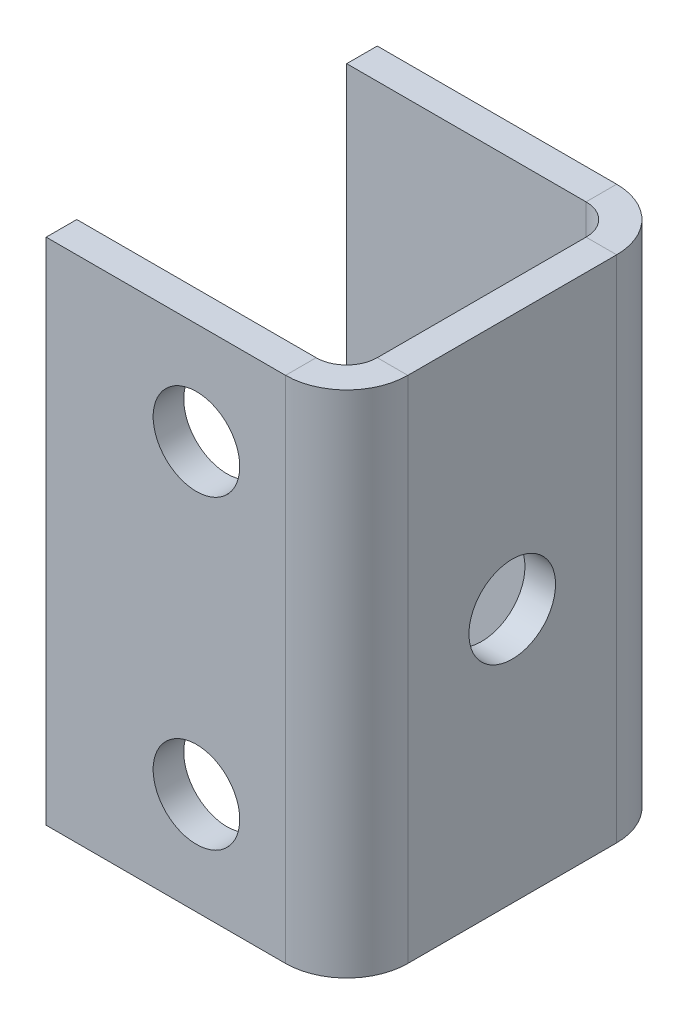
ISO-10303-21;
HEADER;
FILE_DESCRIPTION(('STEP AP214'),'2;1');
FILE_NAME('part.step','',(''),(''),'','','');
FILE_SCHEMA(('AUTOMOTIVE_DESIGN { 1 0 10303 214 1 1 1 1 }'));
ENDSEC;
DATA;
#1=APPLICATION_CONTEXT('core data for automotive mechanical design processes');
#2=APPLICATION_PROTOCOL_DEFINITION('international standard','automotive_design',2000,#1);
#3=PRODUCT_CONTEXT('',#1,'mechanical');
#4=PRODUCT('Part','Part','',(#3));
#5=PRODUCT_RELATED_PRODUCT_CATEGORY('part','',(#4));
#6=PRODUCT_DEFINITION_FORMATION('','',#4);
#7=PRODUCT_DEFINITION_CONTEXT('part definition',#1,'design');
#8=PRODUCT_DEFINITION('design','',#6,#7);
#9=PRODUCT_DEFINITION_SHAPE('','',#8);
#10=(LENGTH_UNIT() NAMED_UNIT(*) SI_UNIT(.MILLI.,.METRE.));
#11=(NAMED_UNIT(*) PLANE_ANGLE_UNIT() SI_UNIT($,.RADIAN.));
#12=(NAMED_UNIT(*) SI_UNIT($,.STERADIAN.) SOLID_ANGLE_UNIT());
#13=UNCERTAINTY_MEASURE_WITH_UNIT(LENGTH_MEASURE(1.E-05),#10,'distance_accuracy_value','');
#14=(GEOMETRIC_REPRESENTATION_CONTEXT(3) GLOBAL_UNCERTAINTY_ASSIGNED_CONTEXT((#13)) GLOBAL_UNIT_ASSIGNED_CONTEXT((#10,
#11,#12)) REPRESENTATION_CONTEXT('',''));
#15=CARTESIAN_POINT('',(0.,0.,0.));
#16=DIRECTION('',(0.,0.,1.));
#17=DIRECTION('',(1.,0.,0.));
#18=AXIS2_PLACEMENT_3D('',#15,#16,#17);
#19=CARTESIAN_POINT('',(574.5,60.,503.5));
#20=DIRECTION('',(0.,-1.,0.));
#21=DIRECTION('',(0.,0.,-1.));
#22=AXIS2_PLACEMENT_3D('',#19,#20,#21);
#23=PLANE('',#22);
#24=DIRECTION('',(1.,0.,0.));
#25=VECTOR('',#24,1.);
#26=CARTESIAN_POINT('',(586.5,60.,503.5));
#27=LINE('',#26,#25);
#28=CARTESIAN_POINT('',(580.5,60.,503.5));
#29=VERTEX_POINT('',#28);
#30=CARTESIAN_POINT('',(586.5,60.,503.5));
#31=VERTEX_POINT('',#30);
#32=EDGE_CURVE('E11',#29,#31,#27,.T.);
#33=ORIENTED_EDGE('',*,*,#32,.F.);
#34=CARTESIAN_POINT('',(574.5,60.,503.5));
#35=DIRECTION('',(0.,1.,0.));
#36=DIRECTION('',(0.,0.,1.));
#37=AXIS2_PLACEMENT_3D('',#34,#35,#36);
#38=CIRCLE('',#37,6.);
#39=CARTESIAN_POINT('',(574.5,60.,509.5));
#40=VERTEX_POINT('',#39);
#41=EDGE_CURVE('E103',#40,#29,#38,.T.);
#42=ORIENTED_EDGE('',*,*,#41,.F.);
#43=DIRECTION('',(0.,0.,1.));
#44=VECTOR('',#43,1.);
#45=CARTESIAN_POINT('',(574.5,60.,515.5));
#46=LINE('',#45,#44);
#47=CARTESIAN_POINT('',(574.5,60.,515.5));
#48=VERTEX_POINT('',#47);
#49=EDGE_CURVE('E51',#40,#48,#46,.T.);
#50=ORIENTED_EDGE('',*,*,#49,.T.);
#51=CARTESIAN_POINT('',(574.5,60.,503.5));
#52=DIRECTION('',(0.,1.,0.));
#53=DIRECTION('',(1.,0.,0.));
#54=AXIS2_PLACEMENT_3D('',#51,#52,#53);
#55=CIRCLE('',#54,12.);
#56=EDGE_CURVE('E106',#48,#31,#55,.T.);
#57=ORIENTED_EDGE('',*,*,#56,.T.);
#58=EDGE_LOOP('',(#33,#42,#50,#57));
#59=FACE_BOUND('',#58,.T.);
#60=ADVANCED_FACE('F40',(#59),#23,.F.);
#61=CARTESIAN_POINT('',(527.5,60.,515.5));
#62=DIRECTION('',(0.,-1.,0.));
#63=DIRECTION('',(1.,0.,0.));
#64=AXIS2_PLACEMENT_3D('',#61,#62,#63);
#65=PLANE('',#64);
#66=ORIENTED_EDGE('',*,*,#49,.F.);
#67=DIRECTION('',(1.,0.,0.));
#68=VECTOR('',#67,1.);
#69=CARTESIAN_POINT('',(527.5,60.,509.5));
#70=LINE('',#69,#68);
#71=CARTESIAN_POINT('',(527.5,60.,509.5));
#72=VERTEX_POINT('',#71);
#73=EDGE_CURVE('E158',#72,#40,#70,.T.);
#74=ORIENTED_EDGE('',*,*,#73,.F.);
#75=DIRECTION('',(0.,0.,1.));
#76=VECTOR('',#75,1.);
#77=CARTESIAN_POINT('',(527.5,60.,515.5));
#78=LINE('',#77,#76);
#79=CARTESIAN_POINT('',(527.5,60.,515.5));
#80=VERTEX_POINT('',#79);
#81=EDGE_CURVE('E188',#72,#80,#78,.T.);
#82=ORIENTED_EDGE('',*,*,#81,.T.);
#83=DIRECTION('',(1.,0.,0.));
#84=VECTOR('',#83,1.);
#85=CARTESIAN_POINT('',(527.5,60.,515.5));
#86=LINE('',#85,#84);
#87=EDGE_CURVE('E213',#80,#48,#86,.T.);
#88=ORIENTED_EDGE('',*,*,#87,.T.);
#89=EDGE_LOOP('',(#66,#74,#82,#88));
#90=FACE_BOUND('',#89,.T.);
#91=ADVANCED_FACE('F214',(#90),#65,.F.);
#92=CARTESIAN_POINT('',(527.5,-40.,515.5));
#93=DIRECTION('',(1.,0.,0.));
#94=DIRECTION('',(0.,1.,0.));
#95=AXIS2_PLACEMENT_3D('',#92,#93,#94);
#96=PLANE('',#95);
#97=ORIENTED_EDGE('',*,*,#81,.F.);
#98=DIRECTION('',(0.,1.,0.));
#99=VECTOR('',#98,1.);
#100=CARTESIAN_POINT('',(527.5,-40.,509.5));
#101=LINE('',#100,#99);
#102=CARTESIAN_POINT('',(527.5,-40.,509.5));
#103=VERTEX_POINT('',#102);
#104=EDGE_CURVE('E311',#103,#72,#101,.T.);
#105=ORIENTED_EDGE('',*,*,#104,.F.);
#106=DIRECTION('',(0.,0.,1.));
#107=VECTOR('',#106,1.);
#108=CARTESIAN_POINT('',(527.5,-40.,515.5));
#109=LINE('',#108,#107);
#110=CARTESIAN_POINT('',(527.5,-40.,515.5));
#111=VERTEX_POINT('',#110);
#112=EDGE_CURVE('E184',#103,#111,#109,.T.);
#113=ORIENTED_EDGE('',*,*,#112,.T.);
#114=DIRECTION('',(0.,1.,0.));
#115=VECTOR('',#114,1.);
#116=CARTESIAN_POINT('',(527.5,-40.,515.5));
#117=LINE('',#116,#115);
#118=EDGE_CURVE('E219',#111,#80,#117,.T.);
#119=ORIENTED_EDGE('',*,*,#118,.T.);
#120=EDGE_LOOP('',(#97,#105,#113,#119));
#121=FACE_BOUND('',#120,.T.);
#122=ADVANCED_FACE('F321',(#121),#96,.F.);
#123=CARTESIAN_POINT('',(527.5,-40.,515.5));
#124=DIRECTION('',(0.,-1.,0.));
#125=DIRECTION('',(1.,0.,0.));
#126=AXIS2_PLACEMENT_3D('',#123,#124,#125);
#127=PLANE('',#126);
#128=ORIENTED_EDGE('',*,*,#112,.F.);
#129=DIRECTION('',(1.,0.,0.));
#130=VECTOR('',#129,1.);
#131=CARTESIAN_POINT('',(527.5,-40.,509.5));
#132=LINE('',#131,#130);
#133=CARTESIAN_POINT('',(574.5,-40.,509.5));
#134=VERTEX_POINT('',#133);
#135=EDGE_CURVE('E285',#103,#134,#132,.T.);
#136=ORIENTED_EDGE('',*,*,#135,.T.);
#137=DIRECTION('',(0.,0.,1.));
#138=VECTOR('',#137,1.);
#139=CARTESIAN_POINT('',(574.5,-40.,515.5));
#140=LINE('',#139,#138);
#141=CARTESIAN_POINT('',(574.5,-40.,515.5));
#142=VERTEX_POINT('',#141);
#143=EDGE_CURVE('E180',#134,#142,#140,.T.);
#144=ORIENTED_EDGE('',*,*,#143,.T.);
#145=DIRECTION('',(1.,0.,0.));
#146=VECTOR('',#145,1.);
#147=CARTESIAN_POINT('',(527.5,-40.,515.5));
#148=LINE('',#147,#146);
#149=EDGE_CURVE('E225',#111,#142,#148,.T.);
#150=ORIENTED_EDGE('',*,*,#149,.F.);
#151=EDGE_LOOP('',(#128,#136,#144,#150));
#152=FACE_BOUND('',#151,.T.);
#153=ADVANCED_FACE('F403',(#152),#127,.T.);
#154=CARTESIAN_POINT('',(574.5,-40.,503.5));
#155=DIRECTION('',(0.,-1.,0.));
#156=DIRECTION('',(0.,0.,-1.));
#157=AXIS2_PLACEMENT_3D('',#154,#155,#156);
#158=PLANE('',#157);
#159=ORIENTED_EDGE('',*,*,#143,.F.);
#160=CARTESIAN_POINT('',(574.5,-40.,503.5));
#161=DIRECTION('',(0.,1.,0.));
#162=DIRECTION('',(0.,0.,1.));
#163=AXIS2_PLACEMENT_3D('',#160,#161,#162);
#164=CIRCLE('',#163,6.);
#165=CARTESIAN_POINT('',(580.5,-40.,503.5));
#166=VERTEX_POINT('',#165);
#167=EDGE_CURVE('E134',#134,#166,#164,.T.);
#168=ORIENTED_EDGE('',*,*,#167,.T.);
#169=DIRECTION('',(1.,0.,0.));
#170=VECTOR('',#169,1.);
#171=CARTESIAN_POINT('',(586.5,-40.,503.5));
#172=LINE('',#171,#170);
#173=CARTESIAN_POINT('',(586.5,-40.,503.5));
#174=VERTEX_POINT('',#173);
#175=EDGE_CURVE('E176',#166,#174,#172,.T.);
#176=ORIENTED_EDGE('',*,*,#175,.T.);
#177=CARTESIAN_POINT('',(574.5,-40.,503.5));
#178=DIRECTION('',(0.,1.,0.));
#179=DIRECTION('',(1.,0.,0.));
#180=AXIS2_PLACEMENT_3D('',#177,#178,#179);
#181=CIRCLE('',#180,12.);
#182=EDGE_CURVE('E209',#142,#174,#181,.T.);
#183=ORIENTED_EDGE('',*,*,#182,.F.);
#184=EDGE_LOOP('',(#159,#168,#176,#183));
#185=FACE_BOUND('',#184,.T.);
#186=ADVANCED_FACE('F399',(#185),#158,.T.);
#187=CARTESIAN_POINT('',(586.5,-40.,509.5));
#188=DIRECTION('',(0.,-1.,0.));
#189=DIRECTION('',(0.,0.,-1.));
#190=AXIS2_PLACEMENT_3D('',#187,#188,#189);
#191=PLANE('',#190);
#192=ORIENTED_EDGE('',*,*,#175,.F.);
#193=DIRECTION('',(0.,0.,-1.));
#194=VECTOR('',#193,1.);
#195=CARTESIAN_POINT('',(580.5,-40.,509.5));
#196=LINE('',#195,#194);
#197=CARTESIAN_POINT('',(580.5,-40.,462.5));
#198=VERTEX_POINT('',#197);
#199=EDGE_CURVE('E122',#166,#198,#196,.T.);
#200=ORIENTED_EDGE('',*,*,#199,.T.);
#201=DIRECTION('',(1.,0.,0.));
#202=VECTOR('',#201,1.);
#203=CARTESIAN_POINT('',(586.5,-40.,462.5));
#204=LINE('',#203,#202);
#205=CARTESIAN_POINT('',(586.5,-40.,462.5));
#206=VERTEX_POINT('',#205);
#207=EDGE_CURVE('E172',#198,#206,#204,.T.);
#208=ORIENTED_EDGE('',*,*,#207,.T.);
#209=DIRECTION('',(0.,0.,-1.));
#210=VECTOR('',#209,1.);
#211=CARTESIAN_POINT('',(586.5,-40.,509.5));
#212=LINE('',#211,#210);
#213=EDGE_CURVE('E243',#174,#206,#212,.T.);
#214=ORIENTED_EDGE('',*,*,#213,.F.);
#215=EDGE_LOOP('',(#192,#200,#208,#214));
#216=FACE_BOUND('',#215,.T.);
#217=ADVANCED_FACE('F395',(#216),#191,.T.);
#218=CARTESIAN_POINT('',(574.5,-40.,462.5));
#219=DIRECTION('',(0.,-1.,0.));
#220=DIRECTION('',(0.,0.,-1.));
#221=AXIS2_PLACEMENT_3D('',#218,#219,#220);
#222=PLANE('',#221);
#223=ORIENTED_EDGE('',*,*,#207,.F.);
#224=CARTESIAN_POINT('',(574.5,-40.,462.5));
#225=DIRECTION('',(0.,1.,0.));
#226=DIRECTION('',(0.,0.,1.));
#227=AXIS2_PLACEMENT_3D('',#224,#225,#226);
#228=CIRCLE('',#227,6.);
#229=CARTESIAN_POINT('',(574.5,-40.,456.5));
#230=VERTEX_POINT('',#229);
#231=EDGE_CURVE('E290',#198,#230,#228,.T.);
#232=ORIENTED_EDGE('',*,*,#231,.T.);
#233=DIRECTION('',(0.,0.,-1.));
#234=VECTOR('',#233,1.);
#235=CARTESIAN_POINT('',(574.5,-40.,450.5));
#236=LINE('',#235,#234);
#237=CARTESIAN_POINT('',(574.5,-40.,450.5));
#238=VERTEX_POINT('',#237);
#239=EDGE_CURVE('E168',#230,#238,#236,.T.);
#240=ORIENTED_EDGE('',*,*,#239,.T.);
#241=CARTESIAN_POINT('',(574.5,-40.,462.5));
#242=DIRECTION('',(0.,1.,0.));
#243=DIRECTION('',(1.,0.,0.));
#244=AXIS2_PLACEMENT_3D('',#241,#242,#243);
#245=CIRCLE('',#244,12.);
#246=EDGE_CURVE('E271',#206,#238,#245,.T.);
#247=ORIENTED_EDGE('',*,*,#246,.F.);
#248=EDGE_LOOP('',(#223,#232,#240,#247));
#249=FACE_BOUND('',#248,.T.);
#250=ADVANCED_FACE('F391',(#249),#222,.T.);
#251=CARTESIAN_POINT('',(580.5,-40.,450.5));
#252=DIRECTION('',(0.,1.,0.));
#253=DIRECTION('',(1.,0.,0.));
#254=AXIS2_PLACEMENT_3D('',#251,#252,#253);
#255=PLANE('',#254);
#256=ORIENTED_EDGE('',*,*,#239,.F.);
#257=DIRECTION('',(-1.,0.,0.));
#258=VECTOR('',#257,1.);
#259=CARTESIAN_POINT('',(580.5,-40.,456.5));
#260=LINE('',#259,#258);
#261=CARTESIAN_POINT('',(527.5,-40.,456.5));
#262=VERTEX_POINT('',#261);
#263=EDGE_CURVE('E280',#230,#262,#260,.T.);
#264=ORIENTED_EDGE('',*,*,#263,.T.);
#265=DIRECTION('',(0.,0.,-1.));
#266=VECTOR('',#265,1.);
#267=CARTESIAN_POINT('',(527.5,-40.,450.5));
#268=LINE('',#267,#266);
#269=CARTESIAN_POINT('',(527.5,-40.,450.5));
#270=VERTEX_POINT('',#269);
#271=EDGE_CURVE('E165',#262,#270,#268,.T.);
#272=ORIENTED_EDGE('',*,*,#271,.T.);
#273=DIRECTION('',(1.,0.,0.));
#274=VECTOR('',#273,1.);
#275=CARTESIAN_POINT('',(580.5,-40.,450.5));
#276=LINE('',#275,#274);
#277=EDGE_CURVE('E260',#238,#270,#276,.F.);
#278=ORIENTED_EDGE('',*,*,#277,.F.);
#279=EDGE_LOOP('',(#256,#264,#272,#278));
#280=FACE_BOUND('',#279,.T.);
#281=ADVANCED_FACE('F388',(#280),#255,.F.);
#282=CARTESIAN_POINT('',(527.5,-40.,450.5));
#283=DIRECTION('',(-1.,0.,0.));
#284=DIRECTION('',(0.,1.,0.));
#285=AXIS2_PLACEMENT_3D('',#282,#283,#284);
#286=PLANE('',#285);
#287=ORIENTED_EDGE('',*,*,#271,.F.);
#288=DIRECTION('',(0.,1.,0.));
#289=VECTOR('',#288,1.);
#290=CARTESIAN_POINT('',(527.5,-40.,456.5));
#291=LINE('',#290,#289);
#292=CARTESIAN_POINT('',(527.5,60.,456.5));
#293=VERTEX_POINT('',#292);
#294=EDGE_CURVE('E291',#262,#293,#291,.T.);
#295=ORIENTED_EDGE('',*,*,#294,.T.);
#296=DIRECTION('',(0.,0.,-1.));
#297=VECTOR('',#296,1.);
#298=CARTESIAN_POINT('',(527.5,60.,450.5));
#299=LINE('',#298,#297);
#300=CARTESIAN_POINT('',(527.5,60.,450.5));
#301=VERTEX_POINT('',#300);
#302=EDGE_CURVE('E59',#293,#301,#299,.T.);
#303=ORIENTED_EDGE('',*,*,#302,.T.);
#304=DIRECTION('',(0.,1.,0.));
#305=VECTOR('',#304,1.);
#306=CARTESIAN_POINT('',(527.5,-40.,450.5));
#307=LINE('',#306,#305);
#308=EDGE_CURVE('E264',#270,#301,#307,.T.);
#309=ORIENTED_EDGE('',*,*,#308,.F.);
#310=EDGE_LOOP('',(#287,#295,#303,#309));
#311=FACE_BOUND('',#310,.T.);
#312=ADVANCED_FACE('F382',(#311),#286,.T.);
#313=CARTESIAN_POINT('',(580.5,60.,450.5));
#314=DIRECTION('',(0.,1.,0.));
#315=DIRECTION('',(1.,0.,0.));
#316=AXIS2_PLACEMENT_3D('',#313,#314,#315);
#317=PLANE('',#316);
#318=ORIENTED_EDGE('',*,*,#302,.F.);
#319=DIRECTION('',(-1.,0.,0.));
#320=VECTOR('',#319,1.);
#321=CARTESIAN_POINT('',(580.5,60.,456.5));
#322=LINE('',#321,#320);
#323=CARTESIAN_POINT('',(574.5,60.,456.5));
#324=VERTEX_POINT('',#323);
#325=EDGE_CURVE('E281',#324,#293,#322,.T.);
#326=ORIENTED_EDGE('',*,*,#325,.F.);
#327=DIRECTION('',(0.,0.,-1.));
#328=VECTOR('',#327,1.);
#329=CARTESIAN_POINT('',(574.5,60.,450.5));
#330=LINE('',#329,#328);
#331=CARTESIAN_POINT('',(574.5,60.,450.5));
#332=VERTEX_POINT('',#331);
#333=EDGE_CURVE('E159',#324,#332,#330,.T.);
#334=ORIENTED_EDGE('',*,*,#333,.T.);
#335=DIRECTION('',(1.,0.,0.));
#336=VECTOR('',#335,1.);
#337=CARTESIAN_POINT('',(580.5,60.,450.5));
#338=LINE('',#337,#336);
#339=EDGE_CURVE('E252',#332,#301,#338,.F.);
#340=ORIENTED_EDGE('',*,*,#339,.T.);
#341=EDGE_LOOP('',(#318,#326,#334,#340));
#342=FACE_BOUND('',#341,.T.);
#343=ADVANCED_FACE('F377',(#342),#317,.T.);
#344=CARTESIAN_POINT('',(574.5,60.,462.5));
#345=DIRECTION('',(0.,-1.,0.));
#346=DIRECTION('',(0.,0.,-1.));
#347=AXIS2_PLACEMENT_3D('',#344,#345,#346);
#348=PLANE('',#347);
#349=ORIENTED_EDGE('',*,*,#333,.F.);
#350=CARTESIAN_POINT('',(574.5,60.,462.5));
#351=DIRECTION('',(0.,1.,0.));
#352=DIRECTION('',(0.,0.,1.));
#353=AXIS2_PLACEMENT_3D('',#350,#351,#352);
#354=CIRCLE('',#353,6.);
#355=CARTESIAN_POINT('',(580.5,60.,462.5));
#356=VERTEX_POINT('',#355);
#357=EDGE_CURVE('E286',#356,#324,#354,.T.);
#358=ORIENTED_EDGE('',*,*,#357,.F.);
#359=DIRECTION('',(1.,0.,0.));
#360=VECTOR('',#359,1.);
#361=CARTESIAN_POINT('',(586.5,60.,462.5));
#362=LINE('',#361,#360);
#363=CARTESIAN_POINT('',(586.5,60.,462.5));
#364=VERTEX_POINT('',#363);
#365=EDGE_CURVE('E44',#356,#364,#362,.T.);
#366=ORIENTED_EDGE('',*,*,#365,.T.);
#367=CARTESIAN_POINT('',(574.5,60.,462.5));
#368=DIRECTION('',(0.,1.,0.));
#369=DIRECTION('',(1.,0.,0.));
#370=AXIS2_PLACEMENT_3D('',#367,#368,#369);
#371=CIRCLE('',#370,12.);
#372=EDGE_CURVE('E267',#364,#332,#371,.T.);
#373=ORIENTED_EDGE('',*,*,#372,.T.);
#374=EDGE_LOOP('',(#349,#358,#366,#373));
#375=FACE_BOUND('',#374,.T.);
#376=ADVANCED_FACE('F373',(#375),#348,.F.);
#377=CARTESIAN_POINT('',(557.,40.,515.500000000001));
#378=DIRECTION('',(0.,0.,1.));
#379=DIRECTION('',(1.,0.,0.));
#380=AXIS2_PLACEMENT_3D('',#377,#378,#379);
#381=CYLINDRICAL_SURFACE('',#380,8.49999999999989);
#382=CARTESIAN_POINT('',(557.,40.,515.500000000001));
#383=DIRECTION('',(0.,0.,1.));
#384=DIRECTION('',(1.,0.,0.));
#385=AXIS2_PLACEMENT_3D('',#382,#383,#384);
#386=CIRCLE('',#385,8.49999999999989);
#387=CARTESIAN_POINT('',(565.5,40.,515.500000000001));
#388=VERTEX_POINT('',#387);
#389=EDGE_CURVE('E303',#388,#388,#386,.T.);
#390=ORIENTED_EDGE('',*,*,#389,.T.);
#391=EDGE_LOOP('',(#390));
#392=FACE_BOUND('',#391,.T.);
#393=CARTESIAN_POINT('',(557.,40.,509.500000000001));
#394=DIRECTION('',(0.,0.,1.));
#395=DIRECTION('',(1.,0.,0.));
#396=AXIS2_PLACEMENT_3D('',#393,#394,#395);
#397=CIRCLE('',#396,8.49999999999989);
#398=CARTESIAN_POINT('',(565.5,40.,509.500000000001));
#399=VERTEX_POINT('',#398);
#400=EDGE_CURVE('E150',#399,#399,#397,.T.);
#401=ORIENTED_EDGE('',*,*,#400,.F.);
#402=EDGE_LOOP('',(#401));
#403=FACE_BOUND('',#402,.T.);
#404=ADVANCED_FACE('F335',(#392,#403),#381,.F.);
#405=CARTESIAN_POINT('',(557.,-20.,515.500000000001));
#406=DIRECTION('',(0.,0.,1.));
#407=DIRECTION('',(1.,0.,0.));
#408=AXIS2_PLACEMENT_3D('',#405,#406,#407);
#409=CYLINDRICAL_SURFACE('',#408,8.49999999999989);
#410=CARTESIAN_POINT('',(557.,-20.,515.500000000001));
#411=DIRECTION('',(0.,0.,1.));
#412=DIRECTION('',(1.,0.,0.));
#413=AXIS2_PLACEMENT_3D('',#410,#411,#412);
#414=CIRCLE('',#413,8.49999999999989);
#415=CARTESIAN_POINT('',(565.5,-20.,515.500000000001));
#416=VERTEX_POINT('',#415);
#417=EDGE_CURVE('E220',#416,#416,#414,.T.);
#418=ORIENTED_EDGE('',*,*,#417,.T.);
#419=EDGE_LOOP('',(#418));
#420=FACE_BOUND('',#419,.T.);
#421=CARTESIAN_POINT('',(557.,-20.,509.500000000001));
#422=DIRECTION('',(0.,0.,1.));
#423=DIRECTION('',(1.,0.,0.));
#424=AXIS2_PLACEMENT_3D('',#421,#422,#423);
#425=CIRCLE('',#424,8.49999999999989);
#426=CARTESIAN_POINT('',(565.5,-20.,509.500000000001));
#427=VERTEX_POINT('',#426);
#428=EDGE_CURVE('E154',#427,#427,#425,.T.);
#429=ORIENTED_EDGE('',*,*,#428,.F.);
#430=EDGE_LOOP('',(#429));
#431=FACE_BOUND('',#430,.T.);
#432=ADVANCED_FACE('F42',(#420,#431),#409,.F.);
#433=CARTESIAN_POINT('',(586.5,9.99999999999999,483.));
#434=DIRECTION('',(1.,0.,0.));
#435=DIRECTION('',(0.,0.,-1.));
#436=AXIS2_PLACEMENT_3D('',#433,#434,#435);
#437=CYLINDRICAL_SURFACE('',#436,8.50000000000001);
#438=CARTESIAN_POINT('',(586.5,9.99999999999999,483.));
#439=DIRECTION('',(1.,0.,0.));
#440=DIRECTION('',(0.,0.,-1.));
#441=AXIS2_PLACEMENT_3D('',#438,#439,#440);
#442=CIRCLE('',#441,8.50000000000001);
#443=CARTESIAN_POINT('',(586.5,9.99999999999999,474.5));
#444=VERTEX_POINT('',#443);
#445=EDGE_CURVE('E228',#444,#444,#442,.T.);
#446=ORIENTED_EDGE('',*,*,#445,.T.);
#447=EDGE_LOOP('',(#446));
#448=FACE_BOUND('',#447,.T.);
#449=CARTESIAN_POINT('',(580.5,9.99999999999999,483.));
#450=DIRECTION('',(1.,0.,0.));
#451=DIRECTION('',(0.,0.,-1.));
#452=AXIS2_PLACEMENT_3D('',#449,#450,#451);
#453=CIRCLE('',#452,8.50000000000001);
#454=CARTESIAN_POINT('',(580.5,9.99999999999999,474.5));
#455=VERTEX_POINT('',#454);
#456=EDGE_CURVE('E142',#455,#455,#453,.T.);
#457=ORIENTED_EDGE('',*,*,#456,.F.);
#458=EDGE_LOOP('',(#457));
#459=FACE_BOUND('',#458,.T.);
#460=ADVANCED_FACE('F347',(#448,#459),#437,.F.);
#461=CARTESIAN_POINT('',(586.5,60.,509.5));
#462=DIRECTION('',(0.,-1.,0.));
#463=DIRECTION('',(0.,0.,-1.));
#464=AXIS2_PLACEMENT_3D('',#461,#462,#463);
#465=PLANE('',#464);
#466=DIRECTION('',(0.,0.,-1.));
#467=VECTOR('',#466,1.);
#468=CARTESIAN_POINT('',(580.5,60.,509.5));
#469=LINE('',#468,#467);
#470=EDGE_CURVE('E119',#29,#356,#469,.T.);
#471=ORIENTED_EDGE('',*,*,#470,.F.);
#472=ORIENTED_EDGE('',*,*,#32,.T.);
#473=DIRECTION('',(0.,0.,-1.));
#474=VECTOR('',#473,1.);
#475=CARTESIAN_POINT('',(586.5,60.,509.5));
#476=LINE('',#475,#474);
#477=EDGE_CURVE('E234',#31,#364,#476,.T.);
#478=ORIENTED_EDGE('',*,*,#477,.T.);
#479=ORIENTED_EDGE('',*,*,#365,.F.);
#480=EDGE_LOOP('',(#471,#472,#478,#479));
#481=FACE_BOUND('',#480,.T.);
#482=ADVANCED_FACE('F138',(#481),#465,.F.);
#483=CARTESIAN_POINT('',(574.5,-40.,462.5));
#484=DIRECTION('',(0.,1.,0.));
#485=DIRECTION('',(0.,0.,1.));
#486=AXIS2_PLACEMENT_3D('',#483,#484,#485);
#487=CYLINDRICAL_SURFACE('',#486,12.);
#488=ORIENTED_EDGE('',*,*,#372,.F.);
#489=DIRECTION('',(0.,1.,0.));
#490=VECTOR('',#489,1.);
#491=CARTESIAN_POINT('',(586.5,-40.,462.5));
#492=LINE('',#491,#490);
#493=EDGE_CURVE('E210',#206,#364,#492,.T.);
#494=ORIENTED_EDGE('',*,*,#493,.F.);
#495=ORIENTED_EDGE('',*,*,#246,.T.);
#496=DIRECTION('',(0.,1.,0.));
#497=VECTOR('',#496,1.);
#498=CARTESIAN_POINT('',(574.5,-40.,450.5));
#499=LINE('',#498,#497);
#500=EDGE_CURVE('E256',#238,#332,#499,.T.);
#501=ORIENTED_EDGE('',*,*,#500,.T.);
#502=EDGE_LOOP('',(#488,#494,#495,#501));
#503=FACE_BOUND('',#502,.T.);
#504=ADVANCED_FACE('F369',(#503),#487,.T.);
#505=CARTESIAN_POINT('',(580.5,-40.,450.5));
#506=DIRECTION('',(0.,0.,-1.));
#507=DIRECTION('',(-1.,0.,0.));
#508=AXIS2_PLACEMENT_3D('',#505,#506,#507);
#509=PLANE('',#508);
#510=ORIENTED_EDGE('',*,*,#339,.F.);
#511=ORIENTED_EDGE('',*,*,#500,.F.);
#512=ORIENTED_EDGE('',*,*,#277,.T.);
#513=ORIENTED_EDGE('',*,*,#308,.T.);
#514=EDGE_LOOP('',(#510,#511,#512,#513));
#515=FACE_BOUND('',#514,.T.);
#516=ADVANCED_FACE('F475',(#515),#509,.T.);
#517=CARTESIAN_POINT('',(574.5,-40.,503.5));
#518=DIRECTION('',(0.,1.,0.));
#519=DIRECTION('',(0.,0.,1.));
#520=AXIS2_PLACEMENT_3D('',#517,#518,#519);
#521=CYLINDRICAL_SURFACE('',#520,12.);
#522=ORIENTED_EDGE('',*,*,#56,.F.);
#523=DIRECTION('',(0.,1.,0.));
#524=VECTOR('',#523,1.);
#525=CARTESIAN_POINT('',(574.5,-40.,515.5));
#526=LINE('',#525,#524);
#527=EDGE_CURVE('E205',#142,#48,#526,.T.);
#528=ORIENTED_EDGE('',*,*,#527,.F.);
#529=ORIENTED_EDGE('',*,*,#182,.T.);
#530=DIRECTION('',(0.,1.,0.));
#531=VECTOR('',#530,1.);
#532=CARTESIAN_POINT('',(586.5,-40.,503.5));
#533=LINE('',#532,#531);
#534=EDGE_CURVE('E207',#174,#31,#533,.T.);
#535=ORIENTED_EDGE('',*,*,#534,.T.);
#536=EDGE_LOOP('',(#522,#528,#529,#535));
#537=FACE_BOUND('',#536,.T.);
#538=ADVANCED_FACE('F202',(#537),#521,.T.);
#539=CARTESIAN_POINT('',(586.5,-40.,509.5));
#540=DIRECTION('',(1.,0.,0.));
#541=DIRECTION('',(0.,0.,-1.));
#542=AXIS2_PLACEMENT_3D('',#539,#540,#541);
#543=PLANE('',#542);
#544=ORIENTED_EDGE('',*,*,#445,.F.);
#545=EDGE_LOOP('',(#544));
#546=FACE_BOUND('',#545,.T.);
#547=ORIENTED_EDGE('',*,*,#477,.F.);
#548=ORIENTED_EDGE('',*,*,#534,.F.);
#549=ORIENTED_EDGE('',*,*,#213,.T.);
#550=ORIENTED_EDGE('',*,*,#493,.T.);
#551=EDGE_LOOP('',(#547,#548,#549,#550));
#552=FACE_BOUND('',#551,.T.);
#553=ADVANCED_FACE('F341',(#546,#552),#543,.T.);
#554=CARTESIAN_POINT('',(527.5,-40.,515.5));
#555=DIRECTION('',(0.,0.,1.));
#556=DIRECTION('',(1.,0.,0.));
#557=AXIS2_PLACEMENT_3D('',#554,#555,#556);
#558=PLANE('',#557);
#559=ORIENTED_EDGE('',*,*,#389,.F.);
#560=EDGE_LOOP('',(#559));
#561=FACE_BOUND('',#560,.T.);
#562=ORIENTED_EDGE('',*,*,#417,.F.);
#563=EDGE_LOOP('',(#562));
#564=FACE_BOUND('',#563,.T.);
#565=ORIENTED_EDGE('',*,*,#87,.F.);
#566=ORIENTED_EDGE('',*,*,#118,.F.);
#567=ORIENTED_EDGE('',*,*,#149,.T.);
#568=ORIENTED_EDGE('',*,*,#527,.T.);
#569=EDGE_LOOP('',(#565,#566,#567,#568));
#570=FACE_BOUND('',#569,.T.);
#571=ADVANCED_FACE('F223',(#561,#564,#570),#558,.T.);
#572=CARTESIAN_POINT('',(574.5,-40.,462.5));
#573=DIRECTION('',(0.,1.,0.));
#574=DIRECTION('',(0.,0.,1.));
#575=AXIS2_PLACEMENT_3D('',#572,#573,#574);
#576=CYLINDRICAL_SURFACE('',#575,6.);
#577=ORIENTED_EDGE('',*,*,#357,.T.);
#578=DIRECTION('',(0.,1.,0.));
#579=VECTOR('',#578,1.);
#580=CARTESIAN_POINT('',(574.5,-40.,456.5));
#581=LINE('',#580,#579);
#582=EDGE_CURVE('E277',#230,#324,#581,.T.);
#583=ORIENTED_EDGE('',*,*,#582,.F.);
#584=ORIENTED_EDGE('',*,*,#231,.F.);
#585=DIRECTION('',(0.,1.,0.));
#586=VECTOR('',#585,1.);
#587=CARTESIAN_POINT('',(580.5,-40.,462.5));
#588=LINE('',#587,#586);
#589=EDGE_CURVE('E135',#198,#356,#588,.T.);
#590=ORIENTED_EDGE('',*,*,#589,.T.);
#591=EDGE_LOOP('',(#577,#583,#584,#590));
#592=FACE_BOUND('',#591,.T.);
#593=ADVANCED_FACE('F340',(#592),#576,.F.);
#594=CARTESIAN_POINT('',(580.5,-40.,456.5));
#595=DIRECTION('',(0.,0.,-1.));
#596=DIRECTION('',(-1.,0.,0.));
#597=AXIS2_PLACEMENT_3D('',#594,#595,#596);
#598=PLANE('',#597);
#599=ORIENTED_EDGE('',*,*,#325,.T.);
#600=ORIENTED_EDGE('',*,*,#294,.F.);
#601=ORIENTED_EDGE('',*,*,#263,.F.);
#602=ORIENTED_EDGE('',*,*,#582,.T.);
#603=EDGE_LOOP('',(#599,#600,#601,#602));
#604=FACE_BOUND('',#603,.T.);
#605=ADVANCED_FACE('F512',(#604),#598,.F.);
#606=CARTESIAN_POINT('',(574.5,-40.,503.5));
#607=DIRECTION('',(0.,1.,0.));
#608=DIRECTION('',(0.,0.,1.));
#609=AXIS2_PLACEMENT_3D('',#606,#607,#608);
#610=CYLINDRICAL_SURFACE('',#609,6.);
#611=ORIENTED_EDGE('',*,*,#41,.T.);
#612=DIRECTION('',(0.,1.,0.));
#613=VECTOR('',#612,1.);
#614=CARTESIAN_POINT('',(580.5,-40.,503.5));
#615=LINE('',#614,#613);
#616=EDGE_CURVE('E116',#166,#29,#615,.T.);
#617=ORIENTED_EDGE('',*,*,#616,.F.);
#618=ORIENTED_EDGE('',*,*,#167,.F.);
#619=DIRECTION('',(0.,1.,0.));
#620=VECTOR('',#619,1.);
#621=CARTESIAN_POINT('',(574.5,-40.,509.5));
#622=LINE('',#621,#620);
#623=EDGE_CURVE('E131',#134,#40,#622,.T.);
#624=ORIENTED_EDGE('',*,*,#623,.T.);
#625=EDGE_LOOP('',(#611,#617,#618,#624));
#626=FACE_BOUND('',#625,.T.);
#627=ADVANCED_FACE('F129',(#626),#610,.F.);
#628=CARTESIAN_POINT('',(580.5,-40.,509.5));
#629=DIRECTION('',(1.,0.,0.));
#630=DIRECTION('',(0.,0.,-1.));
#631=AXIS2_PLACEMENT_3D('',#628,#629,#630);
#632=PLANE('',#631);
#633=ORIENTED_EDGE('',*,*,#456,.T.);
#634=EDGE_LOOP('',(#633));
#635=FACE_BOUND('',#634,.T.);
#636=ORIENTED_EDGE('',*,*,#470,.T.);
#637=ORIENTED_EDGE('',*,*,#589,.F.);
#638=ORIENTED_EDGE('',*,*,#199,.F.);
#639=ORIENTED_EDGE('',*,*,#616,.T.);
#640=EDGE_LOOP('',(#636,#637,#638,#639));
#641=FACE_BOUND('',#640,.T.);
#642=ADVANCED_FACE('F117',(#635,#641),#632,.F.);
#643=CARTESIAN_POINT('',(527.5,-40.,509.5));
#644=DIRECTION('',(0.,0.,1.));
#645=DIRECTION('',(1.,0.,0.));
#646=AXIS2_PLACEMENT_3D('',#643,#644,#645);
#647=PLANE('',#646);
#648=ORIENTED_EDGE('',*,*,#400,.T.);
#649=EDGE_LOOP('',(#648));
#650=FACE_BOUND('',#649,.T.);
#651=ORIENTED_EDGE('',*,*,#428,.T.);
#652=EDGE_LOOP('',(#651));
#653=FACE_BOUND('',#652,.T.);
#654=ORIENTED_EDGE('',*,*,#73,.T.);
#655=ORIENTED_EDGE('',*,*,#623,.F.);
#656=ORIENTED_EDGE('',*,*,#135,.F.);
#657=ORIENTED_EDGE('',*,*,#104,.T.);
#658=EDGE_LOOP('',(#654,#655,#656,#657));
#659=FACE_BOUND('',#658,.T.);
#660=ADVANCED_FACE('F317',(#650,#653,#659),#647,.F.);
#661=CLOSED_SHELL('',(#60,#91,#122,#153,#186,#217,#250,#281,#312,#343,#376,#404,#432,#460,#482,
#504,#516,#538,#553,#571,#593,#605,#627,#642,#660));
#662=MANIFOLD_SOLID_BREP('B2',#661);
#663=ADVANCED_BREP_SHAPE_REPRESENTATION('',(#18,#662),#14);
#664=SHAPE_DEFINITION_REPRESENTATION(#9,#663);
ENDSEC;
END-ISO-10303-21;
